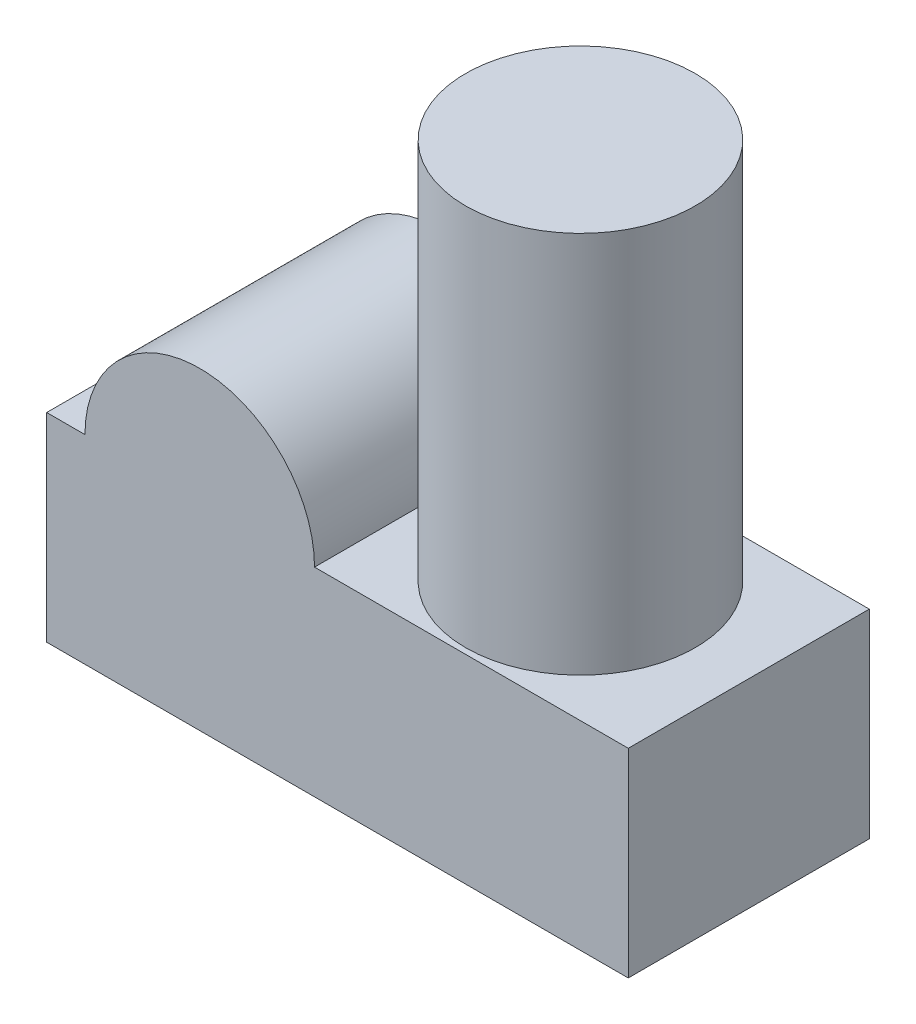
ISO-10303-21;
HEADER;
FILE_DESCRIPTION(('STEP AP214'),'2;1');
FILE_NAME('part.step','',(''),(''),'','','');
FILE_SCHEMA(('AUTOMOTIVE_DESIGN { 1 0 10303 214 1 1 1 1 }'));
ENDSEC;
DATA;
#1=APPLICATION_CONTEXT('core data for automotive mechanical design processes');
#2=APPLICATION_PROTOCOL_DEFINITION('international standard','automotive_design',2000,#1);
#3=PRODUCT_CONTEXT('',#1,'mechanical');
#4=PRODUCT('Part','Part','',(#3));
#5=PRODUCT_RELATED_PRODUCT_CATEGORY('part','',(#4));
#6=PRODUCT_DEFINITION_FORMATION('','',#4);
#7=PRODUCT_DEFINITION_CONTEXT('part definition',#1,'design');
#8=PRODUCT_DEFINITION('design','',#6,#7);
#9=PRODUCT_DEFINITION_SHAPE('','',#8);
#10=(LENGTH_UNIT() NAMED_UNIT(*) SI_UNIT(.MILLI.,.METRE.));
#11=(NAMED_UNIT(*) PLANE_ANGLE_UNIT() SI_UNIT($,.RADIAN.));
#12=(NAMED_UNIT(*) SI_UNIT($,.STERADIAN.) SOLID_ANGLE_UNIT());
#13=UNCERTAINTY_MEASURE_WITH_UNIT(LENGTH_MEASURE(1.E-05),#10,'distance_accuracy_value','');
#14=(GEOMETRIC_REPRESENTATION_CONTEXT(3) GLOBAL_UNCERTAINTY_ASSIGNED_CONTEXT((#13)) GLOBAL_UNIT_ASSIGNED_CONTEXT((#10,
#11,#12)) REPRESENTATION_CONTEXT('',''));
#15=CARTESIAN_POINT('',(0.,0.,0.));
#16=DIRECTION('',(0.,0.,1.));
#17=DIRECTION('',(1.,0.,0.));
#18=AXIS2_PLACEMENT_3D('',#15,#16,#17);
#19=CARTESIAN_POINT('',(0.,0.,31.5));
#20=DIRECTION('',(1.,0.,0.));
#21=DIRECTION('',(0.,0.,-1.));
#22=AXIS2_PLACEMENT_3D('',#19,#20,#21);
#23=PLANE('',#22);
#24=DIRECTION('',(0.,-1.,0.));
#25=VECTOR('',#24,1.);
#26=CARTESIAN_POINT('',(0.,0.,0.));
#27=LINE('',#26,#25);
#28=CARTESIAN_POINT('',(0.,26.,0.));
#29=VERTEX_POINT('',#28);
#30=CARTESIAN_POINT('',(0.,0.,0.));
#31=VERTEX_POINT('',#30);
#32=EDGE_CURVE('E118',#29,#31,#27,.T.);
#33=ORIENTED_EDGE('',*,*,#32,.T.);
#34=DIRECTION('',(0.,0.,-1.));
#35=VECTOR('',#34,1.);
#36=CARTESIAN_POINT('',(0.,0.,31.5));
#37=LINE('',#36,#35);
#38=CARTESIAN_POINT('',(0.,0.,31.5));
#39=VERTEX_POINT('',#38);
#40=EDGE_CURVE('E41',#39,#31,#37,.T.);
#41=ORIENTED_EDGE('',*,*,#40,.F.);
#42=DIRECTION('',(0.,-1.,0.));
#43=VECTOR('',#42,1.);
#44=CARTESIAN_POINT('',(0.,0.,31.5));
#45=LINE('',#44,#43);
#46=CARTESIAN_POINT('',(0.,26.,31.5));
#47=VERTEX_POINT('',#46);
#48=EDGE_CURVE('E129',#47,#39,#45,.T.);
#49=ORIENTED_EDGE('',*,*,#48,.F.);
#50=DIRECTION('',(0.,0.,-1.));
#51=VECTOR('',#50,1.);
#52=CARTESIAN_POINT('',(0.,26.,31.5));
#53=LINE('',#52,#51);
#54=EDGE_CURVE('E114',#47,#29,#53,.T.);
#55=ORIENTED_EDGE('',*,*,#54,.T.);
#56=EDGE_LOOP('',(#33,#41,#49,#55));
#57=FACE_BOUND('',#56,.T.);
#58=ADVANCED_FACE('F33',(#57),#23,.F.);
#59=CARTESIAN_POINT('',(0.,0.,31.5));
#60=DIRECTION('',(0.,1.,0.));
#61=DIRECTION('',(0.,0.,1.));
#62=AXIS2_PLACEMENT_3D('',#59,#60,#61);
#63=PLANE('',#62);
#64=DIRECTION('',(1.,0.,0.));
#65=VECTOR('',#64,1.);
#66=CARTESIAN_POINT('',(0.,0.,0.));
#67=LINE('',#66,#65);
#68=CARTESIAN_POINT('',(76.,0.,0.));
#69=VERTEX_POINT('',#68);
#70=EDGE_CURVE('E121',#31,#69,#67,.T.);
#71=ORIENTED_EDGE('',*,*,#70,.T.);
#72=DIRECTION('',(0.,0.,-1.));
#73=VECTOR('',#72,1.);
#74=CARTESIAN_POINT('',(76.,0.,31.5));
#75=LINE('',#74,#73);
#76=CARTESIAN_POINT('',(76.,0.,31.5));
#77=VERTEX_POINT('',#76);
#78=EDGE_CURVE('E133',#77,#69,#75,.T.);
#79=ORIENTED_EDGE('',*,*,#78,.F.);
#80=DIRECTION('',(1.,0.,0.));
#81=VECTOR('',#80,1.);
#82=CARTESIAN_POINT('',(0.,0.,31.5));
#83=LINE('',#82,#81);
#84=EDGE_CURVE('E87',#39,#77,#83,.T.);
#85=ORIENTED_EDGE('',*,*,#84,.F.);
#86=ORIENTED_EDGE('',*,*,#40,.T.);
#87=EDGE_LOOP('',(#71,#79,#85,#86));
#88=FACE_BOUND('',#87,.T.);
#89=ADVANCED_FACE('F136',(#88),#63,.F.);
#90=CARTESIAN_POINT('',(76.,0.,31.5));
#91=DIRECTION('',(-1.,0.,0.));
#92=DIRECTION('',(0.,0.,1.));
#93=AXIS2_PLACEMENT_3D('',#90,#91,#92);
#94=PLANE('',#93);
#95=DIRECTION('',(0.,1.,0.));
#96=VECTOR('',#95,1.);
#97=CARTESIAN_POINT('',(76.,0.,0.));
#98=LINE('',#97,#96);
#99=CARTESIAN_POINT('',(76.,26.,0.));
#100=VERTEX_POINT('',#99);
#101=EDGE_CURVE('E124',#69,#100,#98,.T.);
#102=ORIENTED_EDGE('',*,*,#101,.T.);
#103=DIRECTION('',(0.,0.,-1.));
#104=VECTOR('',#103,1.);
#105=CARTESIAN_POINT('',(76.,26.,31.5));
#106=LINE('',#105,#104);
#107=CARTESIAN_POINT('',(76.,26.,31.5));
#108=VERTEX_POINT('',#107);
#109=EDGE_CURVE('E109',#108,#100,#106,.T.);
#110=ORIENTED_EDGE('',*,*,#109,.F.);
#111=DIRECTION('',(0.,1.,0.));
#112=VECTOR('',#111,1.);
#113=CARTESIAN_POINT('',(76.,0.,31.5));
#114=LINE('',#113,#112);
#115=EDGE_CURVE('E100',#77,#108,#114,.T.);
#116=ORIENTED_EDGE('',*,*,#115,.F.);
#117=ORIENTED_EDGE('',*,*,#78,.T.);
#118=EDGE_LOOP('',(#102,#110,#116,#117));
#119=FACE_BOUND('',#118,.T.);
#120=ADVANCED_FACE('F144',(#119),#94,.F.);
#121=CARTESIAN_POINT('',(35.,26.,31.5));
#122=DIRECTION('',(0.,-1.,0.));
#123=DIRECTION('',(0.,0.,-1.));
#124=AXIS2_PLACEMENT_3D('',#121,#122,#123);
#125=PLANE('',#124);
#126=CARTESIAN_POINT('',(54.,26.,15.75));
#127=DIRECTION('',(0.,-1.,0.));
#128=DIRECTION('',(0.,0.,-1.));
#129=AXIS2_PLACEMENT_3D('',#126,#127,#128);
#130=CIRCLE('',#129,15.);
#131=CARTESIAN_POINT('',(54.,26.,0.749999999999995));
#132=VERTEX_POINT('',#131);
#133=EDGE_CURVE('E11',#132,#132,#130,.F.);
#134=ORIENTED_EDGE('',*,*,#133,.F.);
#135=EDGE_LOOP('',(#134));
#136=FACE_BOUND('',#135,.T.);
#137=DIRECTION('',(-1.,0.,0.));
#138=VECTOR('',#137,1.);
#139=CARTESIAN_POINT('',(35.,26.,0.));
#140=LINE('',#139,#138);
#141=CARTESIAN_POINT('',(35.,26.,0.));
#142=VERTEX_POINT('',#141);
#143=EDGE_CURVE('E108',#100,#142,#140,.T.);
#144=ORIENTED_EDGE('',*,*,#143,.T.);
#145=DIRECTION('',(0.,0.,-1.));
#146=VECTOR('',#145,1.);
#147=CARTESIAN_POINT('',(35.,26.,31.5));
#148=LINE('',#147,#146);
#149=CARTESIAN_POINT('',(35.,26.,31.5));
#150=VERTEX_POINT('',#149);
#151=EDGE_CURVE('E105',#150,#142,#148,.T.);
#152=ORIENTED_EDGE('',*,*,#151,.F.);
#153=DIRECTION('',(-1.,0.,0.));
#154=VECTOR('',#153,1.);
#155=CARTESIAN_POINT('',(35.,26.,31.5));
#156=LINE('',#155,#154);
#157=EDGE_CURVE('E94',#108,#150,#156,.T.);
#158=ORIENTED_EDGE('',*,*,#157,.F.);
#159=ORIENTED_EDGE('',*,*,#109,.T.);
#160=EDGE_LOOP('',(#144,#152,#158,#159));
#161=FACE_BOUND('',#160,.T.);
#162=ADVANCED_FACE('F106',(#136,#161),#125,.F.);
#163=CARTESIAN_POINT('',(20.,26.,31.5));
#164=DIRECTION('',(0.,0.,-1.));
#165=DIRECTION('',(-1.,0.,0.));
#166=AXIS2_PLACEMENT_3D('',#163,#164,#165);
#167=CYLINDRICAL_SURFACE('',#166,15.);
#168=CARTESIAN_POINT('',(20.,26.,0.));
#169=DIRECTION('',(0.,0.,1.));
#170=DIRECTION('',(1.,0.,0.));
#171=AXIS2_PLACEMENT_3D('',#168,#169,#170);
#172=CIRCLE('',#171,15.);
#173=CARTESIAN_POINT('',(5.,26.,0.));
#174=VERTEX_POINT('',#173);
#175=EDGE_CURVE('E72',#142,#174,#172,.T.);
#176=ORIENTED_EDGE('',*,*,#175,.T.);
#177=DIRECTION('',(0.,0.,-1.));
#178=VECTOR('',#177,1.);
#179=CARTESIAN_POINT('',(5.,26.,31.5));
#180=LINE('',#179,#178);
#181=CARTESIAN_POINT('',(5.,26.,31.5));
#182=VERTEX_POINT('',#181);
#183=EDGE_CURVE('E110',#182,#174,#180,.T.);
#184=ORIENTED_EDGE('',*,*,#183,.F.);
#185=CARTESIAN_POINT('',(20.,26.,31.5));
#186=DIRECTION('',(0.,0.,1.));
#187=DIRECTION('',(1.,0.,0.));
#188=AXIS2_PLACEMENT_3D('',#185,#186,#187);
#189=CIRCLE('',#188,15.);
#190=EDGE_CURVE('E98',#150,#182,#189,.T.);
#191=ORIENTED_EDGE('',*,*,#190,.F.);
#192=ORIENTED_EDGE('',*,*,#151,.T.);
#193=EDGE_LOOP('',(#176,#184,#191,#192));
#194=FACE_BOUND('',#193,.T.);
#195=ADVANCED_FACE('F112',(#194),#167,.T.);
#196=CARTESIAN_POINT('',(0.,26.,31.5));
#197=DIRECTION('',(0.,-1.,0.));
#198=DIRECTION('',(0.,0.,-1.));
#199=AXIS2_PLACEMENT_3D('',#196,#197,#198);
#200=PLANE('',#199);
#201=DIRECTION('',(-1.,0.,0.));
#202=VECTOR('',#201,1.);
#203=CARTESIAN_POINT('',(0.,26.,0.));
#204=LINE('',#203,#202);
#205=EDGE_CURVE('E78',#174,#29,#204,.T.);
#206=ORIENTED_EDGE('',*,*,#205,.T.);
#207=ORIENTED_EDGE('',*,*,#54,.F.);
#208=DIRECTION('',(-1.,0.,0.));
#209=VECTOR('',#208,1.);
#210=CARTESIAN_POINT('',(0.,26.,31.5));
#211=LINE('',#210,#209);
#212=EDGE_CURVE('E49',#182,#47,#211,.T.);
#213=ORIENTED_EDGE('',*,*,#212,.F.);
#214=ORIENTED_EDGE('',*,*,#183,.T.);
#215=EDGE_LOOP('',(#206,#207,#213,#214));
#216=FACE_BOUND('',#215,.T.);
#217=ADVANCED_FACE('F165',(#216),#200,.F.);
#218=CARTESIAN_POINT('',(20.,26.,31.5));
#219=DIRECTION('',(0.,0.,1.));
#220=DIRECTION('',(1.,0.,0.));
#221=AXIS2_PLACEMENT_3D('',#218,#219,#220);
#222=PLANE('',#221);
#223=ORIENTED_EDGE('',*,*,#48,.T.);
#224=ORIENTED_EDGE('',*,*,#84,.T.);
#225=ORIENTED_EDGE('',*,*,#115,.T.);
#226=ORIENTED_EDGE('',*,*,#157,.T.);
#227=ORIENTED_EDGE('',*,*,#190,.T.);
#228=ORIENTED_EDGE('',*,*,#212,.T.);
#229=EDGE_LOOP('',(#223,#224,#225,#226,#227,#228));
#230=FACE_BOUND('',#229,.T.);
#231=ADVANCED_FACE('F96',(#230),#222,.T.);
#232=CARTESIAN_POINT('',(20.,26.,0.));
#233=DIRECTION('',(0.,0.,1.));
#234=DIRECTION('',(1.,0.,0.));
#235=AXIS2_PLACEMENT_3D('',#232,#233,#234);
#236=PLANE('',#235);
#237=ORIENTED_EDGE('',*,*,#32,.F.);
#238=ORIENTED_EDGE('',*,*,#205,.F.);
#239=ORIENTED_EDGE('',*,*,#175,.F.);
#240=ORIENTED_EDGE('',*,*,#143,.F.);
#241=ORIENTED_EDGE('',*,*,#101,.F.);
#242=ORIENTED_EDGE('',*,*,#70,.F.);
#243=EDGE_LOOP('',(#237,#238,#239,#240,#241,#242));
#244=FACE_BOUND('',#243,.T.);
#245=ADVANCED_FACE('F141',(#244),#236,.F.);
#246=CARTESIAN_POINT('',(54.,76.,15.75));
#247=DIRECTION('',(0.,-1.,0.));
#248=DIRECTION('',(0.,0.,-1.));
#249=AXIS2_PLACEMENT_3D('',#246,#247,#248);
#250=CYLINDRICAL_SURFACE('',#249,15.);
#251=CARTESIAN_POINT('',(54.,76.,15.75));
#252=DIRECTION('',(0.,1.,0.));
#253=DIRECTION('',(0.,0.,1.));
#254=AXIS2_PLACEMENT_3D('',#251,#252,#253);
#255=CIRCLE('',#254,15.);
#256=CARTESIAN_POINT('',(54.,76.,30.75));
#257=VERTEX_POINT('',#256);
#258=EDGE_CURVE('E122',#257,#257,#255,.T.);
#259=ORIENTED_EDGE('',*,*,#258,.F.);
#260=EDGE_LOOP('',(#259));
#261=FACE_BOUND('',#260,.T.);
#262=ORIENTED_EDGE('',*,*,#133,.T.);
#263=EDGE_LOOP('',(#262));
#264=FACE_BOUND('',#263,.T.);
#265=ADVANCED_FACE('F153',(#261,#264),#250,.T.);
#266=CARTESIAN_POINT('',(54.,76.,15.75));
#267=DIRECTION('',(0.,1.,0.));
#268=DIRECTION('',(0.,0.,1.));
#269=AXIS2_PLACEMENT_3D('',#266,#267,#268);
#270=PLANE('',#269);
#271=ORIENTED_EDGE('',*,*,#258,.T.);
#272=EDGE_LOOP('',(#271));
#273=FACE_BOUND('',#272,.T.);
#274=ADVANCED_FACE('F151',(#273),#270,.T.);
#275=CLOSED_SHELL('',(#58,#89,#120,#162,#195,#217,#231,#245,#265,#274));
#276=MANIFOLD_SOLID_BREP('B2',#275);
#277=ADVANCED_BREP_SHAPE_REPRESENTATION('',(#18,#276),#14);
#278=SHAPE_DEFINITION_REPRESENTATION(#9,#277);
ENDSEC;
END-ISO-10303-21;
